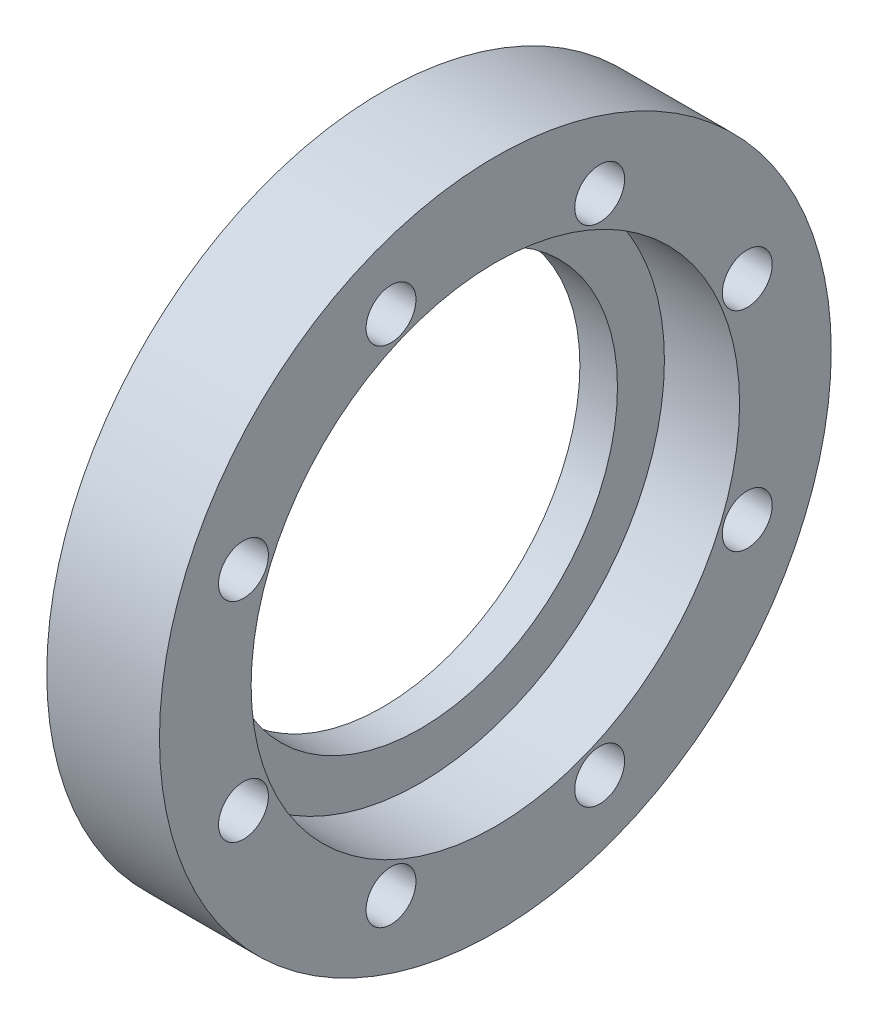
ISO-10303-21;
HEADER;
FILE_DESCRIPTION(('STEP AP214'),'2;1');
FILE_NAME('part.step','',(''),(''),'','','');
FILE_SCHEMA(('AUTOMOTIVE_DESIGN { 1 0 10303 214 1 1 1 1 }'));
ENDSEC;
DATA;
#1=APPLICATION_CONTEXT('core data for automotive mechanical design processes');
#2=APPLICATION_PROTOCOL_DEFINITION('international standard','automotive_design',2000,#1);
#3=PRODUCT_CONTEXT('',#1,'mechanical');
#4=PRODUCT('Part','Part','',(#3));
#5=PRODUCT_RELATED_PRODUCT_CATEGORY('part','',(#4));
#6=PRODUCT_DEFINITION_FORMATION('','',#4);
#7=PRODUCT_DEFINITION_CONTEXT('part definition',#1,'design');
#8=PRODUCT_DEFINITION('design','',#6,#7);
#9=PRODUCT_DEFINITION_SHAPE('','',#8);
#10=(LENGTH_UNIT() NAMED_UNIT(*) SI_UNIT(.MILLI.,.METRE.));
#11=(NAMED_UNIT(*) PLANE_ANGLE_UNIT() SI_UNIT($,.RADIAN.));
#12=(NAMED_UNIT(*) SI_UNIT($,.STERADIAN.) SOLID_ANGLE_UNIT());
#13=UNCERTAINTY_MEASURE_WITH_UNIT(LENGTH_MEASURE(1.E-05),#10,'distance_accuracy_value','');
#14=(GEOMETRIC_REPRESENTATION_CONTEXT(3) GLOBAL_UNCERTAINTY_ASSIGNED_CONTEXT((#13)) GLOBAL_UNIT_ASSIGNED_CONTEXT((#10,
#11,#12)) REPRESENTATION_CONTEXT('',''));
#15=CARTESIAN_POINT('',(0.,0.,0.));
#16=DIRECTION('',(0.,0.,1.));
#17=DIRECTION('',(1.,0.,0.));
#18=AXIS2_PLACEMENT_3D('',#15,#16,#17);
#19=CARTESIAN_POINT('',(6.3499999999999,37.30625,0.));
#20=DIRECTION('',(1.,0.,0.));
#21=DIRECTION('',(0.,0.,-1.));
#22=AXIS2_PLACEMENT_3D('',#19,#20,#21);
#23=PLANE('',#22);
#24=CARTESIAN_POINT('',(6.3499999999999,0.,0.));
#25=DIRECTION('',(1.,0.,0.));
#26=DIRECTION('',(0.,0.,-1.));
#27=AXIS2_PLACEMENT_3D('',#24,#25,#26);
#28=CIRCLE('',#27,33.3375);
#29=CARTESIAN_POINT('',(6.3499999999999,0.,-33.3375));
#30=VERTEX_POINT('',#29);
#31=EDGE_CURVE('E83',#30,#30,#28,.F.);
#32=ORIENTED_EDGE('',*,*,#31,.T.);
#33=EDGE_LOOP('',(#32));
#34=FACE_BOUND('',#33,.T.);
#35=CARTESIAN_POINT('',(6.3499999999999,0.,0.));
#36=DIRECTION('',(1.,0.,0.));
#37=DIRECTION('',(0.,0.,-1.));
#38=AXIS2_PLACEMENT_3D('',#35,#36,#37);
#39=CIRCLE('',#38,41.275);
#40=CARTESIAN_POINT('',(6.3499999999999,0.,-41.275));
#41=VERTEX_POINT('',#40);
#42=EDGE_CURVE('E19',#41,#41,#39,.T.);
#43=ORIENTED_EDGE('',*,*,#42,.T.);
#44=EDGE_LOOP('',(#43));
#45=FACE_BOUND('',#44,.T.);
#46=ADVANCED_FACE('F15',(#34,#45),#23,.T.);
#47=CARTESIAN_POINT('',(12.6999999999999,0.,0.));
#48=DIRECTION('',(1.,0.,0.));
#49=DIRECTION('',(0.,0.,-1.));
#50=AXIS2_PLACEMENT_3D('',#47,#48,#49);
#51=CYLINDRICAL_SURFACE('',#50,41.275);
#52=CARTESIAN_POINT('',(19.05,0.,0.));
#53=DIRECTION('',(1.,0.,0.));
#54=DIRECTION('',(0.,0.,-1.));
#55=AXIS2_PLACEMENT_3D('',#52,#53,#54);
#56=CIRCLE('',#55,41.275);
#57=CARTESIAN_POINT('',(19.05,0.,-41.275));
#58=VERTEX_POINT('',#57);
#59=EDGE_CURVE('E57',#58,#58,#56,.F.);
#60=ORIENTED_EDGE('',*,*,#59,.F.);
#61=EDGE_LOOP('',(#60));
#62=FACE_BOUND('',#61,.T.);
#63=ORIENTED_EDGE('',*,*,#42,.F.);
#64=EDGE_LOOP('',(#63));
#65=FACE_BOUND('',#64,.T.);
#66=ADVANCED_FACE('F91',(#62,#65),#51,.F.);
#67=CARTESIAN_POINT('',(19.05,-42.568303788177,-17.632368756281));
#68=DIRECTION('',(-1.,0.,0.));
#69=DIRECTION('',(0.,0.,1.));
#70=AXIS2_PLACEMENT_3D('',#67,#68,#69);
#71=CYLINDRICAL_SURFACE('',#70,4.2164);
#72=CARTESIAN_POINT('',(19.05,-42.568303788177,-17.632368756281));
#73=DIRECTION('',(-1.,0.,0.));
#74=DIRECTION('',(0.,0.,1.));
#75=AXIS2_PLACEMENT_3D('',#72,#73,#74);
#76=CIRCLE('',#75,4.2164);
#77=CARTESIAN_POINT('',(19.05,-42.568303788177,-13.415968756281));
#78=VERTEX_POINT('',#77);
#79=EDGE_CURVE('E81',#78,#78,#76,.T.);
#80=ORIENTED_EDGE('',*,*,#79,.F.);
#81=EDGE_LOOP('',(#80));
#82=FACE_BOUND('',#81,.T.);
#83=CARTESIAN_POINT('',(0.,-42.568303788177,-17.632368756281));
#84=DIRECTION('',(-1.,0.,0.));
#85=DIRECTION('',(0.,0.,1.));
#86=AXIS2_PLACEMENT_3D('',#83,#84,#85);
#87=CIRCLE('',#86,4.2164);
#88=CARTESIAN_POINT('',(0.,-42.568303788177,-13.415968756281));
#89=VERTEX_POINT('',#88);
#90=EDGE_CURVE('E54',#89,#89,#87,.F.);
#91=ORIENTED_EDGE('',*,*,#90,.F.);
#92=EDGE_LOOP('',(#91));
#93=FACE_BOUND('',#92,.T.);
#94=ADVANCED_FACE('F93',(#82,#93),#71,.F.);
#95=CARTESIAN_POINT('',(19.05,-42.5683037881771,17.6323687562809));
#96=DIRECTION('',(-1.,0.,0.));
#97=DIRECTION('',(0.,0.,1.));
#98=AXIS2_PLACEMENT_3D('',#95,#96,#97);
#99=CYLINDRICAL_SURFACE('',#98,4.2164);
#100=CARTESIAN_POINT('',(19.05,-42.5683037881771,17.6323687562809));
#101=DIRECTION('',(-1.,0.,0.));
#102=DIRECTION('',(0.,0.,1.));
#103=AXIS2_PLACEMENT_3D('',#100,#101,#102);
#104=CIRCLE('',#103,4.2164);
#105=CARTESIAN_POINT('',(19.05,-42.5683037881771,21.8487687562809));
#106=VERTEX_POINT('',#105);
#107=EDGE_CURVE('E78',#106,#106,#104,.T.);
#108=ORIENTED_EDGE('',*,*,#107,.F.);
#109=EDGE_LOOP('',(#108));
#110=FACE_BOUND('',#109,.T.);
#111=CARTESIAN_POINT('',(0.,-42.5683037881771,17.6323687562809));
#112=DIRECTION('',(-1.,0.,0.));
#113=DIRECTION('',(0.,0.,1.));
#114=AXIS2_PLACEMENT_3D('',#111,#112,#113);
#115=CIRCLE('',#114,4.2164);
#116=CARTESIAN_POINT('',(0.,-42.5683037881771,21.8487687562809));
#117=VERTEX_POINT('',#116);
#118=EDGE_CURVE('E51',#117,#117,#115,.F.);
#119=ORIENTED_EDGE('',*,*,#118,.F.);
#120=EDGE_LOOP('',(#119));
#121=FACE_BOUND('',#120,.T.);
#122=ADVANCED_FACE('F101',(#110,#121),#99,.F.);
#123=CARTESIAN_POINT('',(19.05,-17.632368756281,42.568303788177));
#124=DIRECTION('',(-1.,0.,0.));
#125=DIRECTION('',(0.,0.,1.));
#126=AXIS2_PLACEMENT_3D('',#123,#124,#125);
#127=CYLINDRICAL_SURFACE('',#126,4.2164);
#128=CARTESIAN_POINT('',(19.05,-17.632368756281,42.568303788177));
#129=DIRECTION('',(-1.,0.,0.));
#130=DIRECTION('',(0.,0.,1.));
#131=AXIS2_PLACEMENT_3D('',#128,#129,#130);
#132=CIRCLE('',#131,4.2164);
#133=CARTESIAN_POINT('',(19.05,-17.632368756281,46.784703788177));
#134=VERTEX_POINT('',#133);
#135=EDGE_CURVE('E75',#134,#134,#132,.T.);
#136=ORIENTED_EDGE('',*,*,#135,.F.);
#137=EDGE_LOOP('',(#136));
#138=FACE_BOUND('',#137,.T.);
#139=CARTESIAN_POINT('',(0.,-17.632368756281,42.568303788177));
#140=DIRECTION('',(-1.,0.,0.));
#141=DIRECTION('',(0.,0.,1.));
#142=AXIS2_PLACEMENT_3D('',#139,#140,#141);
#143=CIRCLE('',#142,4.2164);
#144=CARTESIAN_POINT('',(0.,-17.632368756281,46.784703788177));
#145=VERTEX_POINT('',#144);
#146=EDGE_CURVE('E48',#145,#145,#143,.F.);
#147=ORIENTED_EDGE('',*,*,#146,.F.);
#148=EDGE_LOOP('',(#147));
#149=FACE_BOUND('',#148,.T.);
#150=ADVANCED_FACE('F151',(#138,#149),#127,.F.);
#151=CARTESIAN_POINT('',(19.05,17.6323687562809,42.5683037881771));
#152=DIRECTION('',(-1.,0.,0.));
#153=DIRECTION('',(0.,0.,1.));
#154=AXIS2_PLACEMENT_3D('',#151,#152,#153);
#155=CYLINDRICAL_SURFACE('',#154,4.2164);
#156=CARTESIAN_POINT('',(19.05,17.6323687562809,42.5683037881771));
#157=DIRECTION('',(-1.,0.,0.));
#158=DIRECTION('',(0.,0.,1.));
#159=AXIS2_PLACEMENT_3D('',#156,#157,#158);
#160=CIRCLE('',#159,4.2164);
#161=CARTESIAN_POINT('',(19.05,17.6323687562809,46.7847037881771));
#162=VERTEX_POINT('',#161);
#163=EDGE_CURVE('E72',#162,#162,#160,.T.);
#164=ORIENTED_EDGE('',*,*,#163,.F.);
#165=EDGE_LOOP('',(#164));
#166=FACE_BOUND('',#165,.T.);
#167=CARTESIAN_POINT('',(0.,17.6323687562809,42.5683037881771));
#168=DIRECTION('',(-1.,0.,0.));
#169=DIRECTION('',(0.,0.,1.));
#170=AXIS2_PLACEMENT_3D('',#167,#168,#169);
#171=CIRCLE('',#170,4.2164);
#172=CARTESIAN_POINT('',(0.,17.6323687562809,46.7847037881771));
#173=VERTEX_POINT('',#172);
#174=EDGE_CURVE('E45',#173,#173,#171,.F.);
#175=ORIENTED_EDGE('',*,*,#174,.F.);
#176=EDGE_LOOP('',(#175));
#177=FACE_BOUND('',#176,.T.);
#178=ADVANCED_FACE('F157',(#166,#177),#155,.F.);
#179=CARTESIAN_POINT('',(19.05,42.568303788177,17.632368756281));
#180=DIRECTION('',(-1.,0.,0.));
#181=DIRECTION('',(0.,0.,1.));
#182=AXIS2_PLACEMENT_3D('',#179,#180,#181);
#183=CYLINDRICAL_SURFACE('',#182,4.2164);
#184=CARTESIAN_POINT('',(19.05,42.568303788177,17.632368756281));
#185=DIRECTION('',(-1.,0.,0.));
#186=DIRECTION('',(0.,0.,1.));
#187=AXIS2_PLACEMENT_3D('',#184,#185,#186);
#188=CIRCLE('',#187,4.2164);
#189=CARTESIAN_POINT('',(19.05,42.568303788177,21.848768756281));
#190=VERTEX_POINT('',#189);
#191=EDGE_CURVE('E69',#190,#190,#188,.T.);
#192=ORIENTED_EDGE('',*,*,#191,.F.);
#193=EDGE_LOOP('',(#192));
#194=FACE_BOUND('',#193,.T.);
#195=CARTESIAN_POINT('',(0.,42.568303788177,17.632368756281));
#196=DIRECTION('',(-1.,0.,0.));
#197=DIRECTION('',(0.,0.,1.));
#198=AXIS2_PLACEMENT_3D('',#195,#196,#197);
#199=CIRCLE('',#198,4.2164);
#200=CARTESIAN_POINT('',(0.,42.568303788177,21.848768756281));
#201=VERTEX_POINT('',#200);
#202=EDGE_CURVE('E42',#201,#201,#199,.F.);
#203=ORIENTED_EDGE('',*,*,#202,.F.);
#204=EDGE_LOOP('',(#203));
#205=FACE_BOUND('',#204,.T.);
#206=ADVANCED_FACE('F164',(#194,#205),#183,.F.);
#207=CARTESIAN_POINT('',(19.05,42.568303788177,-17.6323687562809));
#208=DIRECTION('',(-1.,0.,0.));
#209=DIRECTION('',(0.,0.,1.));
#210=AXIS2_PLACEMENT_3D('',#207,#208,#209);
#211=CYLINDRICAL_SURFACE('',#210,4.21639999999998);
#212=CARTESIAN_POINT('',(19.05,42.568303788177,-17.6323687562809));
#213=DIRECTION('',(-1.,0.,0.));
#214=DIRECTION('',(0.,0.,1.));
#215=AXIS2_PLACEMENT_3D('',#212,#213,#214);
#216=CIRCLE('',#215,4.21639999999998);
#217=CARTESIAN_POINT('',(19.05,42.568303788177,-13.4159687562809));
#218=VERTEX_POINT('',#217);
#219=EDGE_CURVE('E66',#218,#218,#216,.T.);
#220=ORIENTED_EDGE('',*,*,#219,.F.);
#221=EDGE_LOOP('',(#220));
#222=FACE_BOUND('',#221,.T.);
#223=CARTESIAN_POINT('',(0.,42.568303788177,-17.6323687562809));
#224=DIRECTION('',(-1.,0.,0.));
#225=DIRECTION('',(0.,0.,1.));
#226=AXIS2_PLACEMENT_3D('',#223,#224,#225);
#227=CIRCLE('',#226,4.21639999999998);
#228=CARTESIAN_POINT('',(0.,42.568303788177,-13.4159687562809));
#229=VERTEX_POINT('',#228);
#230=EDGE_CURVE('E39',#229,#229,#227,.F.);
#231=ORIENTED_EDGE('',*,*,#230,.F.);
#232=EDGE_LOOP('',(#231));
#233=FACE_BOUND('',#232,.T.);
#234=ADVANCED_FACE('F168',(#222,#233),#211,.F.);
#235=CARTESIAN_POINT('',(19.05,-17.6323687562809,-42.5683037881771));
#236=DIRECTION('',(-1.,0.,0.));
#237=DIRECTION('',(0.,0.,1.));
#238=AXIS2_PLACEMENT_3D('',#235,#236,#237);
#239=CYLINDRICAL_SURFACE('',#238,4.2164);
#240=CARTESIAN_POINT('',(19.05,-17.6323687562809,-42.5683037881771));
#241=DIRECTION('',(-1.,0.,0.));
#242=DIRECTION('',(0.,0.,1.));
#243=AXIS2_PLACEMENT_3D('',#240,#241,#242);
#244=CIRCLE('',#243,4.2164);
#245=CARTESIAN_POINT('',(19.05,-17.6323687562809,-38.3519037881771));
#246=VERTEX_POINT('',#245);
#247=EDGE_CURVE('E63',#246,#246,#244,.T.);
#248=ORIENTED_EDGE('',*,*,#247,.F.);
#249=EDGE_LOOP('',(#248));
#250=FACE_BOUND('',#249,.T.);
#251=CARTESIAN_POINT('',(0.,-17.6323687562809,-42.5683037881771));
#252=DIRECTION('',(-1.,0.,0.));
#253=DIRECTION('',(0.,0.,1.));
#254=AXIS2_PLACEMENT_3D('',#251,#252,#253);
#255=CIRCLE('',#254,4.2164);
#256=CARTESIAN_POINT('',(0.,-17.6323687562809,-38.3519037881771));
#257=VERTEX_POINT('',#256);
#258=EDGE_CURVE('E36',#257,#257,#255,.F.);
#259=ORIENTED_EDGE('',*,*,#258,.F.);
#260=EDGE_LOOP('',(#259));
#261=FACE_BOUND('',#260,.T.);
#262=ADVANCED_FACE('F127',(#250,#261),#239,.F.);
#263=CARTESIAN_POINT('',(19.05,17.632368756281,-42.568303788177));
#264=DIRECTION('',(-1.,0.,0.));
#265=DIRECTION('',(0.,0.,1.));
#266=AXIS2_PLACEMENT_3D('',#263,#264,#265);
#267=CYLINDRICAL_SURFACE('',#266,4.2164);
#268=CARTESIAN_POINT('',(19.05,17.632368756281,-42.568303788177));
#269=DIRECTION('',(-1.,0.,0.));
#270=DIRECTION('',(0.,0.,1.));
#271=AXIS2_PLACEMENT_3D('',#268,#269,#270);
#272=CIRCLE('',#271,4.2164);
#273=CARTESIAN_POINT('',(19.05,17.632368756281,-38.351903788177));
#274=VERTEX_POINT('',#273);
#275=EDGE_CURVE('E60',#274,#274,#272,.T.);
#276=ORIENTED_EDGE('',*,*,#275,.F.);
#277=EDGE_LOOP('',(#276));
#278=FACE_BOUND('',#277,.T.);
#279=CARTESIAN_POINT('',(0.,17.632368756281,-42.568303788177));
#280=DIRECTION('',(-1.,0.,0.));
#281=DIRECTION('',(0.,0.,1.));
#282=AXIS2_PLACEMENT_3D('',#279,#280,#281);
#283=CIRCLE('',#282,4.2164);
#284=CARTESIAN_POINT('',(0.,17.632368756281,-38.351903788177));
#285=VERTEX_POINT('',#284);
#286=EDGE_CURVE('E33',#285,#285,#283,.F.);
#287=ORIENTED_EDGE('',*,*,#286,.F.);
#288=EDGE_LOOP('',(#287));
#289=FACE_BOUND('',#288,.T.);
#290=ADVANCED_FACE('F17',(#278,#289),#267,.F.);
#291=CARTESIAN_POINT('',(3.17499999999992,0.,0.));
#292=DIRECTION('',(1.,0.,0.));
#293=DIRECTION('',(0.,0.,-1.));
#294=AXIS2_PLACEMENT_3D('',#291,#292,#293);
#295=CYLINDRICAL_SURFACE('',#294,33.3375);
#296=ORIENTED_EDGE('',*,*,#31,.F.);
#297=EDGE_LOOP('',(#296));
#298=FACE_BOUND('',#297,.T.);
#299=CARTESIAN_POINT('',(0.,0.,0.));
#300=DIRECTION('',(1.,0.,0.));
#301=DIRECTION('',(0.,0.,-1.));
#302=AXIS2_PLACEMENT_3D('',#299,#300,#301);
#303=CIRCLE('',#302,33.3375);
#304=CARTESIAN_POINT('',(0.,0.,-33.3375));
#305=VERTEX_POINT('',#304);
#306=EDGE_CURVE('E28',#305,#305,#303,.T.);
#307=ORIENTED_EDGE('',*,*,#306,.F.);
#308=EDGE_LOOP('',(#307));
#309=FACE_BOUND('',#308,.T.);
#310=ADVANCED_FACE('F120',(#298,#309),#295,.F.);
#311=CARTESIAN_POINT('',(19.05,49.0219999999995,0.));
#312=DIRECTION('',(1.,0.,0.));
#313=DIRECTION('',(0.,0.,-1.));
#314=AXIS2_PLACEMENT_3D('',#311,#312,#313);
#315=PLANE('',#314);
#316=ORIENTED_EDGE('',*,*,#59,.T.);
#317=EDGE_LOOP('',(#316));
#318=FACE_BOUND('',#317,.T.);
#319=ORIENTED_EDGE('',*,*,#275,.T.);
#320=EDGE_LOOP('',(#319));
#321=FACE_BOUND('',#320,.T.);
#322=ORIENTED_EDGE('',*,*,#247,.T.);
#323=EDGE_LOOP('',(#322));
#324=FACE_BOUND('',#323,.T.);
#325=ORIENTED_EDGE('',*,*,#219,.T.);
#326=EDGE_LOOP('',(#325));
#327=FACE_BOUND('',#326,.T.);
#328=ORIENTED_EDGE('',*,*,#191,.T.);
#329=EDGE_LOOP('',(#328));
#330=FACE_BOUND('',#329,.T.);
#331=ORIENTED_EDGE('',*,*,#163,.T.);
#332=EDGE_LOOP('',(#331));
#333=FACE_BOUND('',#332,.T.);
#334=ORIENTED_EDGE('',*,*,#135,.T.);
#335=EDGE_LOOP('',(#334));
#336=FACE_BOUND('',#335,.T.);
#337=ORIENTED_EDGE('',*,*,#107,.T.);
#338=EDGE_LOOP('',(#337));
#339=FACE_BOUND('',#338,.T.);
#340=ORIENTED_EDGE('',*,*,#79,.T.);
#341=EDGE_LOOP('',(#340));
#342=FACE_BOUND('',#341,.T.);
#343=CARTESIAN_POINT('',(19.0500000000001,0.,0.));
#344=DIRECTION('',(1.,0.,0.));
#345=DIRECTION('',(0.,0.,-1.));
#346=AXIS2_PLACEMENT_3D('',#343,#344,#345);
#347=CIRCLE('',#346,56.7689999999989);
#348=CARTESIAN_POINT('',(19.0500000000001,0.,-56.7689999999989));
#349=VERTEX_POINT('',#348);
#350=EDGE_CURVE('E23',#349,#349,#347,.F.);
#351=ORIENTED_EDGE('',*,*,#350,.F.);
#352=EDGE_LOOP('',(#351));
#353=FACE_BOUND('',#352,.T.);
#354=ADVANCED_FACE('F114',(#318,#321,#324,#327,#330,#333,#336,#339,#342,#353),#315,.T.);
#355=CARTESIAN_POINT('',(0.,45.0532499999995,0.));
#356=DIRECTION('',(-1.,0.,0.));
#357=DIRECTION('',(0.,0.,1.));
#358=AXIS2_PLACEMENT_3D('',#355,#356,#357);
#359=PLANE('',#358);
#360=ORIENTED_EDGE('',*,*,#306,.T.);
#361=EDGE_LOOP('',(#360));
#362=FACE_BOUND('',#361,.T.);
#363=ORIENTED_EDGE('',*,*,#286,.T.);
#364=EDGE_LOOP('',(#363));
#365=FACE_BOUND('',#364,.T.);
#366=ORIENTED_EDGE('',*,*,#258,.T.);
#367=EDGE_LOOP('',(#366));
#368=FACE_BOUND('',#367,.T.);
#369=ORIENTED_EDGE('',*,*,#230,.T.);
#370=EDGE_LOOP('',(#369));
#371=FACE_BOUND('',#370,.T.);
#372=ORIENTED_EDGE('',*,*,#202,.T.);
#373=EDGE_LOOP('',(#372));
#374=FACE_BOUND('',#373,.T.);
#375=ORIENTED_EDGE('',*,*,#174,.T.);
#376=EDGE_LOOP('',(#375));
#377=FACE_BOUND('',#376,.T.);
#378=ORIENTED_EDGE('',*,*,#146,.T.);
#379=EDGE_LOOP('',(#378));
#380=FACE_BOUND('',#379,.T.);
#381=ORIENTED_EDGE('',*,*,#118,.T.);
#382=EDGE_LOOP('',(#381));
#383=FACE_BOUND('',#382,.T.);
#384=ORIENTED_EDGE('',*,*,#90,.T.);
#385=EDGE_LOOP('',(#384));
#386=FACE_BOUND('',#385,.T.);
#387=CARTESIAN_POINT('',(0.,0.,0.));
#388=DIRECTION('',(1.,0.,0.));
#389=DIRECTION('',(0.,0.,-1.));
#390=AXIS2_PLACEMENT_3D('',#387,#388,#389);
#391=CIRCLE('',#390,56.7689999999989);
#392=CARTESIAN_POINT('',(0.,0.,-56.7689999999989));
#393=VERTEX_POINT('',#392);
#394=EDGE_CURVE('E10',#393,#393,#391,.T.);
#395=ORIENTED_EDGE('',*,*,#394,.F.);
#396=EDGE_LOOP('',(#395));
#397=FACE_BOUND('',#396,.T.);
#398=ADVANCED_FACE('F109',(#362,#365,#368,#371,#374,#377,#380,#383,#386,#397),#359,.T.);
#399=CARTESIAN_POINT('',(9.52500000000005,0.,0.));
#400=DIRECTION('',(1.,0.,0.));
#401=DIRECTION('',(0.,0.,-1.));
#402=AXIS2_PLACEMENT_3D('',#399,#400,#401);
#403=CYLINDRICAL_SURFACE('',#402,56.7689999999989);
#404=ORIENTED_EDGE('',*,*,#394,.T.);
#405=EDGE_LOOP('',(#404));
#406=FACE_BOUND('',#405,.T.);
#407=ORIENTED_EDGE('',*,*,#350,.T.);
#408=EDGE_LOOP('',(#407));
#409=FACE_BOUND('',#408,.T.);
#410=ADVANCED_FACE('F107',(#406,#409),#403,.T.);
#411=CLOSED_SHELL('',(#46,#66,#94,#122,#150,#178,#206,#234,#262,#290,#310,#354,#398,#410));
#412=MANIFOLD_SOLID_BREP('B1',#411);
#413=ADVANCED_BREP_SHAPE_REPRESENTATION('',(#18,#412),#14);
#414=SHAPE_DEFINITION_REPRESENTATION(#9,#413);
ENDSEC;
END-ISO-10303-21;
